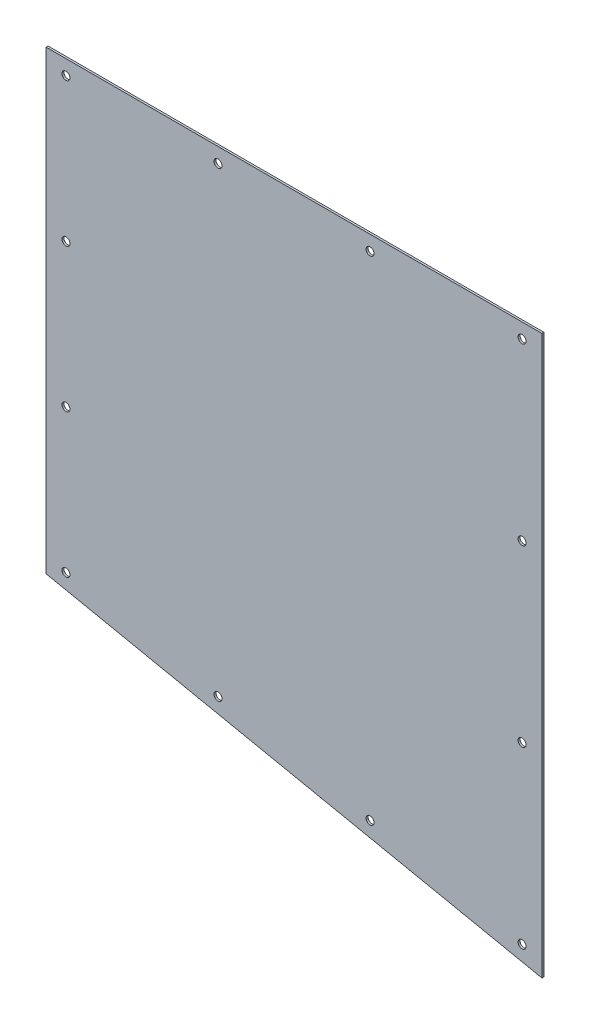
ISO-10303-21;
HEADER;
FILE_DESCRIPTION(('STEP AP214'),'2;1');
FILE_NAME('part.step','',(''),(''),'','','');
FILE_SCHEMA(('AUTOMOTIVE_DESIGN { 1 0 10303 214 1 1 1 1 }'));
ENDSEC;
DATA;
#1=APPLICATION_CONTEXT('core data for automotive mechanical design processes');
#2=APPLICATION_PROTOCOL_DEFINITION('international standard','automotive_design',2000,#1);
#3=PRODUCT_CONTEXT('',#1,'mechanical');
#4=PRODUCT('Part','Part','',(#3));
#5=PRODUCT_RELATED_PRODUCT_CATEGORY('part','',(#4));
#6=PRODUCT_DEFINITION_FORMATION('','',#4);
#7=PRODUCT_DEFINITION_CONTEXT('part definition',#1,'design');
#8=PRODUCT_DEFINITION('design','',#6,#7);
#9=PRODUCT_DEFINITION_SHAPE('','',#8);
#10=(LENGTH_UNIT() NAMED_UNIT(*) SI_UNIT(.MILLI.,.METRE.));
#11=(NAMED_UNIT(*) PLANE_ANGLE_UNIT() SI_UNIT($,.RADIAN.));
#12=(NAMED_UNIT(*) SI_UNIT($,.STERADIAN.) SOLID_ANGLE_UNIT());
#13=UNCERTAINTY_MEASURE_WITH_UNIT(LENGTH_MEASURE(1.E-05),#10,'distance_accuracy_value','');
#14=(GEOMETRIC_REPRESENTATION_CONTEXT(3) GLOBAL_UNCERTAINTY_ASSIGNED_CONTEXT((#13)) GLOBAL_UNIT_ASSIGNED_CONTEXT((#10,
#11,#12)) REPRESENTATION_CONTEXT('',''));
#15=CARTESIAN_POINT('',(0.,0.,0.));
#16=DIRECTION('',(0.,0.,1.));
#17=DIRECTION('',(1.,0.,0.));
#18=AXIS2_PLACEMENT_3D('',#15,#16,#17);
#19=CARTESIAN_POINT('',(-250.,0.,2.));
#20=DIRECTION('',(1.,0.,0.));
#21=DIRECTION('',(0.,1.,0.));
#22=AXIS2_PLACEMENT_3D('',#19,#20,#21);
#23=PLANE('',#22);
#24=DIRECTION('',(0.,-1.,0.));
#25=VECTOR('',#24,1.);
#26=CARTESIAN_POINT('',(-250.,0.,0.));
#27=LINE('',#26,#25);
#28=CARTESIAN_POINT('',(-250.,0.,0.));
#29=VERTEX_POINT('',#28);
#30=CARTESIAN_POINT('',(-250.,-460.,0.));
#31=VERTEX_POINT('',#30);
#32=EDGE_CURVE('E97',#29,#31,#27,.T.);
#33=ORIENTED_EDGE('',*,*,#32,.T.);
#34=DIRECTION('',(0.,0.,-1.));
#35=VECTOR('',#34,1.);
#36=CARTESIAN_POINT('',(-250.,-460.,2.));
#37=LINE('',#36,#35);
#38=CARTESIAN_POINT('',(-250.,-460.,2.));
#39=VERTEX_POINT('',#38);
#40=EDGE_CURVE('E11',#39,#31,#37,.T.);
#41=ORIENTED_EDGE('',*,*,#40,.F.);
#42=DIRECTION('',(0.,-1.,0.));
#43=VECTOR('',#42,1.);
#44=CARTESIAN_POINT('',(-250.,0.,2.));
#45=LINE('',#44,#43);
#46=CARTESIAN_POINT('',(-250.,0.,2.));
#47=VERTEX_POINT('',#46);
#48=EDGE_CURVE('E85',#47,#39,#45,.T.);
#49=ORIENTED_EDGE('',*,*,#48,.F.);
#50=DIRECTION('',(0.,0.,-1.));
#51=VECTOR('',#50,1.);
#52=CARTESIAN_POINT('',(-250.,0.,2.));
#53=LINE('',#52,#51);
#54=EDGE_CURVE('E93',#47,#29,#53,.T.);
#55=ORIENTED_EDGE('',*,*,#54,.T.);
#56=EDGE_LOOP('',(#33,#41,#49,#55));
#57=FACE_BOUND('',#56,.T.);
#58=ADVANCED_FACE('F34',(#57),#23,.F.);
#59=CARTESIAN_POINT('',(-250.,-460.,2.));
#60=DIRECTION('',(0.201763461346261,0.97943427837991,0.));
#61=DIRECTION('',(-0.97943427837991,0.201763461346261,0.));
#62=AXIS2_PLACEMENT_3D('',#59,#60,#61);
#63=PLANE('',#62);
#64=DIRECTION('',(0.97943427837991,-0.201763461346261,0.));
#65=VECTOR('',#64,1.);
#66=CARTESIAN_POINT('',(-250.,-460.,0.));
#67=LINE('',#66,#65);
#68=CARTESIAN_POINT('',(250.,-563.,0.));
#69=VERTEX_POINT('',#68);
#70=EDGE_CURVE('E89',#31,#69,#67,.T.);
#71=ORIENTED_EDGE('',*,*,#70,.T.);
#72=DIRECTION('',(0.,0.,-1.));
#73=VECTOR('',#72,1.);
#74=CARTESIAN_POINT('',(250.,-563.,2.));
#75=LINE('',#74,#73);
#76=CARTESIAN_POINT('',(250.,-563.,2.));
#77=VERTEX_POINT('',#76);
#78=EDGE_CURVE('E42',#77,#69,#75,.T.);
#79=ORIENTED_EDGE('',*,*,#78,.F.);
#80=DIRECTION('',(0.97943427837991,-0.201763461346261,0.));
#81=VECTOR('',#80,1.);
#82=CARTESIAN_POINT('',(-250.,-460.,2.));
#83=LINE('',#82,#81);
#84=EDGE_CURVE('E80',#39,#77,#83,.T.);
#85=ORIENTED_EDGE('',*,*,#84,.F.);
#86=ORIENTED_EDGE('',*,*,#40,.T.);
#87=EDGE_LOOP('',(#71,#79,#85,#86));
#88=FACE_BOUND('',#87,.T.);
#89=ADVANCED_FACE('F88',(#88),#63,.F.);
#90=CARTESIAN_POINT('',(250.,0.,2.));
#91=DIRECTION('',(-1.,0.,0.));
#92=DIRECTION('',(0.,-1.,0.));
#93=AXIS2_PLACEMENT_3D('',#90,#91,#92);
#94=PLANE('',#93);
#95=DIRECTION('',(0.,1.,0.));
#96=VECTOR('',#95,1.);
#97=CARTESIAN_POINT('',(250.,0.,0.));
#98=LINE('',#97,#96);
#99=CARTESIAN_POINT('',(250.,0.,0.));
#100=VERTEX_POINT('',#99);
#101=EDGE_CURVE('E67',#69,#100,#98,.T.);
#102=ORIENTED_EDGE('',*,*,#101,.T.);
#103=DIRECTION('',(0.,0.,-1.));
#104=VECTOR('',#103,1.);
#105=CARTESIAN_POINT('',(250.,0.,2.));
#106=LINE('',#105,#104);
#107=CARTESIAN_POINT('',(250.,0.,2.));
#108=VERTEX_POINT('',#107);
#109=EDGE_CURVE('E90',#108,#100,#106,.T.);
#110=ORIENTED_EDGE('',*,*,#109,.F.);
#111=DIRECTION('',(0.,1.,0.));
#112=VECTOR('',#111,1.);
#113=CARTESIAN_POINT('',(250.,0.,2.));
#114=LINE('',#113,#112);
#115=EDGE_CURVE('E83',#77,#108,#114,.T.);
#116=ORIENTED_EDGE('',*,*,#115,.F.);
#117=ORIENTED_EDGE('',*,*,#78,.T.);
#118=EDGE_LOOP('',(#102,#110,#116,#117));
#119=FACE_BOUND('',#118,.T.);
#120=ADVANCED_FACE('F91',(#119),#94,.F.);
#121=CARTESIAN_POINT('',(-250.,0.,2.));
#122=DIRECTION('',(0.,-1.,0.));
#123=DIRECTION('',(0.,0.,-1.));
#124=AXIS2_PLACEMENT_3D('',#121,#122,#123);
#125=PLANE('',#124);
#126=DIRECTION('',(-1.,0.,0.));
#127=VECTOR('',#126,1.);
#128=CARTESIAN_POINT('',(-250.,0.,0.));
#129=LINE('',#128,#127);
#130=EDGE_CURVE('E73',#100,#29,#129,.T.);
#131=ORIENTED_EDGE('',*,*,#130,.T.);
#132=ORIENTED_EDGE('',*,*,#54,.F.);
#133=DIRECTION('',(-1.,0.,0.));
#134=VECTOR('',#133,1.);
#135=CARTESIAN_POINT('',(-250.,0.,2.));
#136=LINE('',#135,#134);
#137=EDGE_CURVE('E50',#108,#47,#136,.T.);
#138=ORIENTED_EDGE('',*,*,#137,.F.);
#139=ORIENTED_EDGE('',*,*,#109,.T.);
#140=EDGE_LOOP('',(#131,#132,#138,#139));
#141=FACE_BOUND('',#140,.T.);
#142=ADVANCED_FACE('F105',(#141),#125,.F.);
#143=CARTESIAN_POINT('',(0.,0.,2.));
#144=DIRECTION('',(0.,0.,1.));
#145=DIRECTION('',(1.,0.,0.));
#146=AXIS2_PLACEMENT_3D('',#143,#144,#145);
#147=PLANE('',#146);
#148=CARTESIAN_POINT('',(-230.,-448.805036728741,2.));
#149=DIRECTION('',(0.,0.,1.));
#150=DIRECTION('',(1.,0.,0.));
#151=AXIS2_PLACEMENT_3D('',#148,#149,#150);
#152=CIRCLE('',#151,4.00000000000002);
#153=CARTESIAN_POINT('',(-226.,-448.805036728741,2.));
#154=VERTEX_POINT('',#153);
#155=EDGE_CURVE('E176',#154,#154,#152,.T.);
#156=ORIENTED_EDGE('',*,*,#155,.F.);
#157=EDGE_LOOP('',(#156));
#158=FACE_BOUND('',#157,.T.);
#159=CARTESIAN_POINT('',(230.,-191.188345576247,2.));
#160=DIRECTION('',(0.,0.,1.));
#161=DIRECTION('',(1.,0.,0.));
#162=AXIS2_PLACEMENT_3D('',#159,#160,#161);
#163=CIRCLE('',#162,3.99999999999999);
#164=CARTESIAN_POINT('',(234.,-191.188345576247,2.));
#165=VERTEX_POINT('',#164);
#166=EDGE_CURVE('E170',#165,#165,#163,.T.);
#167=ORIENTED_EDGE('',*,*,#166,.F.);
#168=EDGE_LOOP('',(#167));
#169=FACE_BOUND('',#168,.T.);
#170=CARTESIAN_POINT('',(230.,-367.376691152494,2.));
#171=DIRECTION('',(0.,0.,1.));
#172=DIRECTION('',(1.,0.,0.));
#173=AXIS2_PLACEMENT_3D('',#170,#171,#172);
#174=CIRCLE('',#173,3.99999999999999);
#175=CARTESIAN_POINT('',(234.,-367.376691152494,2.));
#176=VERTEX_POINT('',#175);
#177=EDGE_CURVE('E164',#176,#176,#174,.T.);
#178=ORIENTED_EDGE('',*,*,#177,.F.);
#179=EDGE_LOOP('',(#178));
#180=FACE_BOUND('',#179,.T.);
#181=CARTESIAN_POINT('',(230.,-543.565036728741,2.));
#182=DIRECTION('',(0.,0.,1.));
#183=DIRECTION('',(1.,0.,0.));
#184=AXIS2_PLACEMENT_3D('',#181,#182,#183);
#185=CIRCLE('',#184,3.99999999999999);
#186=CARTESIAN_POINT('',(234.,-543.565036728741,2.));
#187=VERTEX_POINT('',#186);
#188=EDGE_CURVE('E158',#187,#187,#185,.T.);
#189=ORIENTED_EDGE('',*,*,#188,.F.);
#190=EDGE_LOOP('',(#189));
#191=FACE_BOUND('',#190,.T.);
#192=CARTESIAN_POINT('',(76.6666666666666,-511.978370062075,2.));
#193=DIRECTION('',(0.,0.,1.));
#194=DIRECTION('',(1.,0.,0.));
#195=AXIS2_PLACEMENT_3D('',#192,#193,#194);
#196=CIRCLE('',#195,4.00000000000001);
#197=CARTESIAN_POINT('',(80.6666666666667,-511.978370062075,2.));
#198=VERTEX_POINT('',#197);
#199=EDGE_CURVE('E152',#198,#198,#196,.T.);
#200=ORIENTED_EDGE('',*,*,#199,.F.);
#201=EDGE_LOOP('',(#200));
#202=FACE_BOUND('',#201,.T.);
#203=CARTESIAN_POINT('',(-76.6666666666667,-480.391703395408,2.));
#204=DIRECTION('',(0.,0.,1.));
#205=DIRECTION('',(1.,0.,0.));
#206=AXIS2_PLACEMENT_3D('',#203,#204,#205);
#207=CIRCLE('',#206,4.00000000000001);
#208=CARTESIAN_POINT('',(-72.6666666666667,-480.391703395408,2.));
#209=VERTEX_POINT('',#208);
#210=EDGE_CURVE('E146',#209,#209,#207,.T.);
#211=ORIENTED_EDGE('',*,*,#210,.F.);
#212=EDGE_LOOP('',(#211));
#213=FACE_BOUND('',#212,.T.);
#214=CARTESIAN_POINT('',(-230.,-304.203357819161,2.));
#215=DIRECTION('',(0.,0.,1.));
#216=DIRECTION('',(1.,0.,0.));
#217=AXIS2_PLACEMENT_3D('',#214,#215,#216);
#218=CIRCLE('',#217,3.99999999999999);
#219=CARTESIAN_POINT('',(-226.,-304.203357819161,2.));
#220=VERTEX_POINT('',#219);
#221=EDGE_CURVE('E140',#220,#220,#218,.T.);
#222=ORIENTED_EDGE('',*,*,#221,.F.);
#223=EDGE_LOOP('',(#222));
#224=FACE_BOUND('',#223,.T.);
#225=CARTESIAN_POINT('',(-230.,-159.60167890958,2.));
#226=DIRECTION('',(0.,0.,1.));
#227=DIRECTION('',(1.,0.,0.));
#228=AXIS2_PLACEMENT_3D('',#225,#226,#227);
#229=CIRCLE('',#228,4.00000000000002);
#230=CARTESIAN_POINT('',(-226.,-159.60167890958,2.));
#231=VERTEX_POINT('',#230);
#232=EDGE_CURVE('E134',#231,#231,#229,.T.);
#233=ORIENTED_EDGE('',*,*,#232,.F.);
#234=EDGE_LOOP('',(#233));
#235=FACE_BOUND('',#234,.T.);
#236=CARTESIAN_POINT('',(-230.,-15.,2.));
#237=DIRECTION('',(0.,0.,1.));
#238=DIRECTION('',(1.,0.,0.));
#239=AXIS2_PLACEMENT_3D('',#236,#237,#238);
#240=CIRCLE('',#239,3.99999999999999);
#241=CARTESIAN_POINT('',(-226.,-15.,2.));
#242=VERTEX_POINT('',#241);
#243=EDGE_CURVE('E128',#242,#242,#240,.T.);
#244=ORIENTED_EDGE('',*,*,#243,.F.);
#245=EDGE_LOOP('',(#244));
#246=FACE_BOUND('',#245,.T.);
#247=CARTESIAN_POINT('',(-76.6666666666666,-15.,2.));
#248=DIRECTION('',(0.,0.,1.));
#249=DIRECTION('',(1.,0.,0.));
#250=AXIS2_PLACEMENT_3D('',#247,#248,#249);
#251=CIRCLE('',#250,4.00000000000001);
#252=CARTESIAN_POINT('',(-72.6666666666666,-15.,2.));
#253=VERTEX_POINT('',#252);
#254=EDGE_CURVE('E122',#253,#253,#251,.T.);
#255=ORIENTED_EDGE('',*,*,#254,.F.);
#256=EDGE_LOOP('',(#255));
#257=FACE_BOUND('',#256,.T.);
#258=CARTESIAN_POINT('',(76.6666666666667,-15.,2.));
#259=DIRECTION('',(0.,0.,1.));
#260=DIRECTION('',(1.,0.,0.));
#261=AXIS2_PLACEMENT_3D('',#258,#259,#260);
#262=CIRCLE('',#261,4.00000000000001);
#263=CARTESIAN_POINT('',(80.6666666666667,-15.,2.));
#264=VERTEX_POINT('',#263);
#265=EDGE_CURVE('E116',#264,#264,#262,.T.);
#266=ORIENTED_EDGE('',*,*,#265,.F.);
#267=EDGE_LOOP('',(#266));
#268=FACE_BOUND('',#267,.T.);
#269=CARTESIAN_POINT('',(230.,-15.,2.));
#270=DIRECTION('',(0.,0.,1.));
#271=DIRECTION('',(1.,0.,0.));
#272=AXIS2_PLACEMENT_3D('',#269,#270,#271);
#273=CIRCLE('',#272,3.99999999999999);
#274=CARTESIAN_POINT('',(234.,-15.,2.));
#275=VERTEX_POINT('',#274);
#276=EDGE_CURVE('E100',#275,#275,#273,.T.);
#277=ORIENTED_EDGE('',*,*,#276,.F.);
#278=EDGE_LOOP('',(#277));
#279=FACE_BOUND('',#278,.T.);
#280=ORIENTED_EDGE('',*,*,#48,.T.);
#281=ORIENTED_EDGE('',*,*,#84,.T.);
#282=ORIENTED_EDGE('',*,*,#115,.T.);
#283=ORIENTED_EDGE('',*,*,#137,.T.);
#284=EDGE_LOOP('',(#280,#281,#282,#283));
#285=FACE_BOUND('',#284,.T.);
#286=ADVANCED_FACE('F81',(#158,#169,#180,#191,#202,#213,#224,#235,#246,#257,#268,#279,#285),
#147,.T.);
#287=CARTESIAN_POINT('',(0.,0.,0.));
#288=DIRECTION('',(0.,0.,1.));
#289=DIRECTION('',(1.,0.,0.));
#290=AXIS2_PLACEMENT_3D('',#287,#288,#289);
#291=PLANE('',#290);
#292=CARTESIAN_POINT('',(-230.,-448.805036728741,0.));
#293=DIRECTION('',(0.,0.,-1.));
#294=DIRECTION('',(-1.,0.,0.));
#295=AXIS2_PLACEMENT_3D('',#292,#293,#294);
#296=CIRCLE('',#295,4.00000000000002);
#297=CARTESIAN_POINT('',(-234.,-448.805036728741,0.));
#298=VERTEX_POINT('',#297);
#299=EDGE_CURVE('E179',#298,#298,#296,.T.);
#300=ORIENTED_EDGE('',*,*,#299,.F.);
#301=EDGE_LOOP('',(#300));
#302=FACE_BOUND('',#301,.T.);
#303=CARTESIAN_POINT('',(230.,-191.188345576247,0.));
#304=DIRECTION('',(0.,0.,-1.));
#305=DIRECTION('',(-1.,0.,0.));
#306=AXIS2_PLACEMENT_3D('',#303,#304,#305);
#307=CIRCLE('',#306,3.99999999999999);
#308=CARTESIAN_POINT('',(226.,-191.188345576247,0.));
#309=VERTEX_POINT('',#308);
#310=EDGE_CURVE('E173',#309,#309,#307,.T.);
#311=ORIENTED_EDGE('',*,*,#310,.F.);
#312=EDGE_LOOP('',(#311));
#313=FACE_BOUND('',#312,.T.);
#314=CARTESIAN_POINT('',(230.,-367.376691152494,0.));
#315=DIRECTION('',(0.,0.,-1.));
#316=DIRECTION('',(-1.,0.,0.));
#317=AXIS2_PLACEMENT_3D('',#314,#315,#316);
#318=CIRCLE('',#317,3.99999999999999);
#319=CARTESIAN_POINT('',(226.,-367.376691152494,0.));
#320=VERTEX_POINT('',#319);
#321=EDGE_CURVE('E167',#320,#320,#318,.T.);
#322=ORIENTED_EDGE('',*,*,#321,.F.);
#323=EDGE_LOOP('',(#322));
#324=FACE_BOUND('',#323,.T.);
#325=CARTESIAN_POINT('',(230.,-543.565036728741,0.));
#326=DIRECTION('',(0.,0.,-1.));
#327=DIRECTION('',(-1.,0.,0.));
#328=AXIS2_PLACEMENT_3D('',#325,#326,#327);
#329=CIRCLE('',#328,3.99999999999999);
#330=CARTESIAN_POINT('',(226.,-543.565036728741,0.));
#331=VERTEX_POINT('',#330);
#332=EDGE_CURVE('E161',#331,#331,#329,.T.);
#333=ORIENTED_EDGE('',*,*,#332,.F.);
#334=EDGE_LOOP('',(#333));
#335=FACE_BOUND('',#334,.T.);
#336=CARTESIAN_POINT('',(76.6666666666666,-511.978370062075,0.));
#337=DIRECTION('',(0.,0.,-1.));
#338=DIRECTION('',(-1.,0.,0.));
#339=AXIS2_PLACEMENT_3D('',#336,#337,#338);
#340=CIRCLE('',#339,4.00000000000001);
#341=CARTESIAN_POINT('',(72.6666666666666,-511.978370062075,0.));
#342=VERTEX_POINT('',#341);
#343=EDGE_CURVE('E155',#342,#342,#340,.T.);
#344=ORIENTED_EDGE('',*,*,#343,.F.);
#345=EDGE_LOOP('',(#344));
#346=FACE_BOUND('',#345,.T.);
#347=CARTESIAN_POINT('',(-76.6666666666667,-480.391703395408,0.));
#348=DIRECTION('',(0.,0.,-1.));
#349=DIRECTION('',(-1.,0.,0.));
#350=AXIS2_PLACEMENT_3D('',#347,#348,#349);
#351=CIRCLE('',#350,4.00000000000001);
#352=CARTESIAN_POINT('',(-80.6666666666667,-480.391703395408,0.));
#353=VERTEX_POINT('',#352);
#354=EDGE_CURVE('E149',#353,#353,#351,.T.);
#355=ORIENTED_EDGE('',*,*,#354,.F.);
#356=EDGE_LOOP('',(#355));
#357=FACE_BOUND('',#356,.T.);
#358=CARTESIAN_POINT('',(-230.,-304.203357819161,0.));
#359=DIRECTION('',(0.,0.,-1.));
#360=DIRECTION('',(-1.,0.,0.));
#361=AXIS2_PLACEMENT_3D('',#358,#359,#360);
#362=CIRCLE('',#361,3.99999999999999);
#363=CARTESIAN_POINT('',(-234.,-304.203357819161,0.));
#364=VERTEX_POINT('',#363);
#365=EDGE_CURVE('E143',#364,#364,#362,.T.);
#366=ORIENTED_EDGE('',*,*,#365,.F.);
#367=EDGE_LOOP('',(#366));
#368=FACE_BOUND('',#367,.T.);
#369=CARTESIAN_POINT('',(-230.,-159.60167890958,0.));
#370=DIRECTION('',(0.,0.,-1.));
#371=DIRECTION('',(-1.,0.,0.));
#372=AXIS2_PLACEMENT_3D('',#369,#370,#371);
#373=CIRCLE('',#372,4.00000000000002);
#374=CARTESIAN_POINT('',(-234.,-159.60167890958,0.));
#375=VERTEX_POINT('',#374);
#376=EDGE_CURVE('E137',#375,#375,#373,.T.);
#377=ORIENTED_EDGE('',*,*,#376,.F.);
#378=EDGE_LOOP('',(#377));
#379=FACE_BOUND('',#378,.T.);
#380=CARTESIAN_POINT('',(-230.,-15.,0.));
#381=DIRECTION('',(0.,0.,-1.));
#382=DIRECTION('',(-1.,0.,0.));
#383=AXIS2_PLACEMENT_3D('',#380,#381,#382);
#384=CIRCLE('',#383,3.99999999999999);
#385=CARTESIAN_POINT('',(-234.,-15.,0.));
#386=VERTEX_POINT('',#385);
#387=EDGE_CURVE('E131',#386,#386,#384,.T.);
#388=ORIENTED_EDGE('',*,*,#387,.F.);
#389=EDGE_LOOP('',(#388));
#390=FACE_BOUND('',#389,.T.);
#391=CARTESIAN_POINT('',(-76.6666666666666,-15.,0.));
#392=DIRECTION('',(0.,0.,-1.));
#393=DIRECTION('',(-1.,0.,0.));
#394=AXIS2_PLACEMENT_3D('',#391,#392,#393);
#395=CIRCLE('',#394,4.00000000000001);
#396=CARTESIAN_POINT('',(-80.6666666666666,-15.,0.));
#397=VERTEX_POINT('',#396);
#398=EDGE_CURVE('E125',#397,#397,#395,.T.);
#399=ORIENTED_EDGE('',*,*,#398,.F.);
#400=EDGE_LOOP('',(#399));
#401=FACE_BOUND('',#400,.T.);
#402=CARTESIAN_POINT('',(76.6666666666667,-15.,0.));
#403=DIRECTION('',(0.,0.,-1.));
#404=DIRECTION('',(-1.,0.,0.));
#405=AXIS2_PLACEMENT_3D('',#402,#403,#404);
#406=CIRCLE('',#405,4.00000000000001);
#407=CARTESIAN_POINT('',(72.6666666666667,-15.,0.));
#408=VERTEX_POINT('',#407);
#409=EDGE_CURVE('E119',#408,#408,#406,.T.);
#410=ORIENTED_EDGE('',*,*,#409,.F.);
#411=EDGE_LOOP('',(#410));
#412=FACE_BOUND('',#411,.T.);
#413=CARTESIAN_POINT('',(230.,-15.,0.));
#414=DIRECTION('',(0.,0.,-1.));
#415=DIRECTION('',(-1.,0.,0.));
#416=AXIS2_PLACEMENT_3D('',#413,#414,#415);
#417=CIRCLE('',#416,3.99999999999999);
#418=CARTESIAN_POINT('',(226.,-15.,0.));
#419=VERTEX_POINT('',#418);
#420=EDGE_CURVE('E113',#419,#419,#417,.T.);
#421=ORIENTED_EDGE('',*,*,#420,.F.);
#422=EDGE_LOOP('',(#421));
#423=FACE_BOUND('',#422,.T.);
#424=ORIENTED_EDGE('',*,*,#32,.F.);
#425=ORIENTED_EDGE('',*,*,#130,.F.);
#426=ORIENTED_EDGE('',*,*,#101,.F.);
#427=ORIENTED_EDGE('',*,*,#70,.F.);
#428=EDGE_LOOP('',(#424,#425,#426,#427));
#429=FACE_BOUND('',#428,.T.);
#430=ADVANCED_FACE('F108',(#302,#313,#324,#335,#346,#357,#368,#379,#390,#401,#412,#423,#429),
#291,.F.);
#431=CARTESIAN_POINT('',(230.,-15.,10.));
#432=DIRECTION('',(0.,0.,-1.));
#433=DIRECTION('',(-1.,0.,0.));
#434=AXIS2_PLACEMENT_3D('',#431,#432,#433);
#435=CYLINDRICAL_SURFACE('',#434,3.99999999999999);
#436=ORIENTED_EDGE('',*,*,#276,.T.);
#437=EDGE_LOOP('',(#436));
#438=FACE_BOUND('',#437,.T.);
#439=ORIENTED_EDGE('',*,*,#420,.T.);
#440=EDGE_LOOP('',(#439));
#441=FACE_BOUND('',#440,.T.);
#442=ADVANCED_FACE('F187',(#438,#441),#435,.F.);
#443=CARTESIAN_POINT('',(76.6666666666667,-15.,10.));
#444=DIRECTION('',(0.,0.,-1.));
#445=DIRECTION('',(-1.,0.,0.));
#446=AXIS2_PLACEMENT_3D('',#443,#444,#445);
#447=CYLINDRICAL_SURFACE('',#446,4.00000000000001);
#448=ORIENTED_EDGE('',*,*,#265,.T.);
#449=EDGE_LOOP('',(#448));
#450=FACE_BOUND('',#449,.T.);
#451=ORIENTED_EDGE('',*,*,#409,.T.);
#452=EDGE_LOOP('',(#451));
#453=FACE_BOUND('',#452,.T.);
#454=ADVANCED_FACE('F212',(#450,#453),#447,.F.);
#455=CARTESIAN_POINT('',(-76.6666666666666,-15.,10.));
#456=DIRECTION('',(0.,0.,-1.));
#457=DIRECTION('',(-1.,0.,0.));
#458=AXIS2_PLACEMENT_3D('',#455,#456,#457);
#459=CYLINDRICAL_SURFACE('',#458,4.00000000000001);
#460=ORIENTED_EDGE('',*,*,#254,.T.);
#461=EDGE_LOOP('',(#460));
#462=FACE_BOUND('',#461,.T.);
#463=ORIENTED_EDGE('',*,*,#398,.T.);
#464=EDGE_LOOP('',(#463));
#465=FACE_BOUND('',#464,.T.);
#466=ADVANCED_FACE('F218',(#462,#465),#459,.F.);
#467=CARTESIAN_POINT('',(-230.,-15.,10.));
#468=DIRECTION('',(0.,0.,-1.));
#469=DIRECTION('',(-1.,0.,0.));
#470=AXIS2_PLACEMENT_3D('',#467,#468,#469);
#471=CYLINDRICAL_SURFACE('',#470,3.99999999999999);
#472=ORIENTED_EDGE('',*,*,#243,.T.);
#473=EDGE_LOOP('',(#472));
#474=FACE_BOUND('',#473,.T.);
#475=ORIENTED_EDGE('',*,*,#387,.T.);
#476=EDGE_LOOP('',(#475));
#477=FACE_BOUND('',#476,.T.);
#478=ADVANCED_FACE('F263',(#474,#477),#471,.F.);
#479=CARTESIAN_POINT('',(-230.,-159.60167890958,10.));
#480=DIRECTION('',(0.,0.,-1.));
#481=DIRECTION('',(-1.,0.,0.));
#482=AXIS2_PLACEMENT_3D('',#479,#480,#481);
#483=CYLINDRICAL_SURFACE('',#482,4.00000000000002);
#484=ORIENTED_EDGE('',*,*,#232,.T.);
#485=EDGE_LOOP('',(#484));
#486=FACE_BOUND('',#485,.T.);
#487=ORIENTED_EDGE('',*,*,#376,.T.);
#488=EDGE_LOOP('',(#487));
#489=FACE_BOUND('',#488,.T.);
#490=ADVANCED_FACE('F268',(#486,#489),#483,.F.);
#491=CARTESIAN_POINT('',(-230.,-304.203357819161,10.));
#492=DIRECTION('',(0.,0.,-1.));
#493=DIRECTION('',(-1.,0.,0.));
#494=AXIS2_PLACEMENT_3D('',#491,#492,#493);
#495=CYLINDRICAL_SURFACE('',#494,3.99999999999999);
#496=ORIENTED_EDGE('',*,*,#221,.T.);
#497=EDGE_LOOP('',(#496));
#498=FACE_BOUND('',#497,.T.);
#499=ORIENTED_EDGE('',*,*,#365,.T.);
#500=EDGE_LOOP('',(#499));
#501=FACE_BOUND('',#500,.T.);
#502=ADVANCED_FACE('F274',(#498,#501),#495,.F.);
#503=CARTESIAN_POINT('',(-76.6666666666667,-480.391703395408,10.));
#504=DIRECTION('',(0.,0.,-1.));
#505=DIRECTION('',(-1.,0.,0.));
#506=AXIS2_PLACEMENT_3D('',#503,#504,#505);
#507=CYLINDRICAL_SURFACE('',#506,4.00000000000001);
#508=ORIENTED_EDGE('',*,*,#210,.T.);
#509=EDGE_LOOP('',(#508));
#510=FACE_BOUND('',#509,.T.);
#511=ORIENTED_EDGE('',*,*,#354,.T.);
#512=EDGE_LOOP('',(#511));
#513=FACE_BOUND('',#512,.T.);
#514=ADVANCED_FACE('F278',(#510,#513),#507,.F.);
#515=CARTESIAN_POINT('',(76.6666666666666,-511.978370062075,10.));
#516=DIRECTION('',(0.,0.,-1.));
#517=DIRECTION('',(-1.,0.,0.));
#518=AXIS2_PLACEMENT_3D('',#515,#516,#517);
#519=CYLINDRICAL_SURFACE('',#518,4.00000000000001);
#520=ORIENTED_EDGE('',*,*,#199,.T.);
#521=EDGE_LOOP('',(#520));
#522=FACE_BOUND('',#521,.T.);
#523=ORIENTED_EDGE('',*,*,#343,.T.);
#524=EDGE_LOOP('',(#523));
#525=FACE_BOUND('',#524,.T.);
#526=ADVANCED_FACE('F282',(#522,#525),#519,.F.);
#527=CARTESIAN_POINT('',(230.,-543.565036728741,10.));
#528=DIRECTION('',(0.,0.,-1.));
#529=DIRECTION('',(-1.,0.,0.));
#530=AXIS2_PLACEMENT_3D('',#527,#528,#529);
#531=CYLINDRICAL_SURFACE('',#530,3.99999999999999);
#532=ORIENTED_EDGE('',*,*,#188,.T.);
#533=EDGE_LOOP('',(#532));
#534=FACE_BOUND('',#533,.T.);
#535=ORIENTED_EDGE('',*,*,#332,.T.);
#536=EDGE_LOOP('',(#535));
#537=FACE_BOUND('',#536,.T.);
#538=ADVANCED_FACE('F286',(#534,#537),#531,.F.);
#539=CARTESIAN_POINT('',(230.,-367.376691152494,10.));
#540=DIRECTION('',(0.,0.,-1.));
#541=DIRECTION('',(-1.,0.,0.));
#542=AXIS2_PLACEMENT_3D('',#539,#540,#541);
#543=CYLINDRICAL_SURFACE('',#542,3.99999999999999);
#544=ORIENTED_EDGE('',*,*,#177,.T.);
#545=EDGE_LOOP('',(#544));
#546=FACE_BOUND('',#545,.T.);
#547=ORIENTED_EDGE('',*,*,#321,.T.);
#548=EDGE_LOOP('',(#547));
#549=FACE_BOUND('',#548,.T.);
#550=ADVANCED_FACE('F290',(#546,#549),#543,.F.);
#551=CARTESIAN_POINT('',(230.,-191.188345576247,10.));
#552=DIRECTION('',(0.,0.,-1.));
#553=DIRECTION('',(-1.,0.,0.));
#554=AXIS2_PLACEMENT_3D('',#551,#552,#553);
#555=CYLINDRICAL_SURFACE('',#554,3.99999999999999);
#556=ORIENTED_EDGE('',*,*,#166,.T.);
#557=EDGE_LOOP('',(#556));
#558=FACE_BOUND('',#557,.T.);
#559=ORIENTED_EDGE('',*,*,#310,.T.);
#560=EDGE_LOOP('',(#559));
#561=FACE_BOUND('',#560,.T.);
#562=ADVANCED_FACE('F294',(#558,#561),#555,.F.);
#563=CARTESIAN_POINT('',(-230.,-448.805036728741,10.));
#564=DIRECTION('',(0.,0.,-1.));
#565=DIRECTION('',(-1.,0.,0.));
#566=AXIS2_PLACEMENT_3D('',#563,#564,#565);
#567=CYLINDRICAL_SURFACE('',#566,4.00000000000002);
#568=ORIENTED_EDGE('',*,*,#155,.T.);
#569=EDGE_LOOP('',(#568));
#570=FACE_BOUND('',#569,.T.);
#571=ORIENTED_EDGE('',*,*,#299,.T.);
#572=EDGE_LOOP('',(#571));
#573=FACE_BOUND('',#572,.T.);
#574=ADVANCED_FACE('F183',(#570,#573),#567,.F.);
#575=CLOSED_SHELL('',(#58,#89,#120,#142,#286,#430,#442,#454,#466,#478,#490,#502,#514,#526,#538,
#550,#562,#574));
#576=MANIFOLD_SOLID_BREP('B2',#575);
#577=ADVANCED_BREP_SHAPE_REPRESENTATION('',(#18,#576),#14);
#578=SHAPE_DEFINITION_REPRESENTATION(#9,#577);
ENDSEC;
END-ISO-10303-21;
